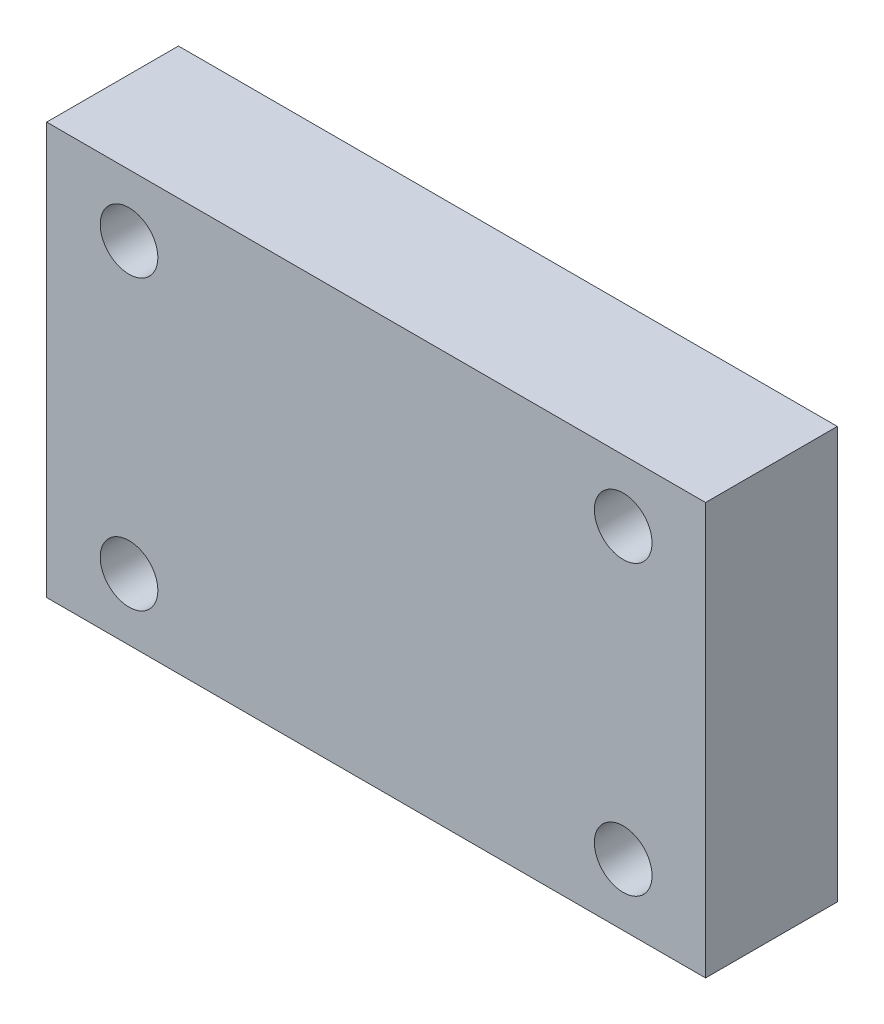
ISO-10303-21;
HEADER;
FILE_DESCRIPTION(('STEP AP214'),'2;1');
FILE_NAME('part.step','',(''),(''),'','','');
FILE_SCHEMA(('AUTOMOTIVE_DESIGN { 1 0 10303 214 1 1 1 1 }'));
ENDSEC;
DATA;
#1=APPLICATION_CONTEXT('core data for automotive mechanical design processes');
#2=APPLICATION_PROTOCOL_DEFINITION('international standard','automotive_design',2000,#1);
#3=PRODUCT_CONTEXT('',#1,'mechanical');
#4=PRODUCT('Part','Part','',(#3));
#5=PRODUCT_RELATED_PRODUCT_CATEGORY('part','',(#4));
#6=PRODUCT_DEFINITION_FORMATION('','',#4);
#7=PRODUCT_DEFINITION_CONTEXT('part definition',#1,'design');
#8=PRODUCT_DEFINITION('design','',#6,#7);
#9=PRODUCT_DEFINITION_SHAPE('','',#8);
#10=(LENGTH_UNIT() NAMED_UNIT(*) SI_UNIT(.MILLI.,.METRE.));
#11=(NAMED_UNIT(*) PLANE_ANGLE_UNIT() SI_UNIT($,.RADIAN.));
#12=(NAMED_UNIT(*) SI_UNIT($,.STERADIAN.) SOLID_ANGLE_UNIT());
#13=UNCERTAINTY_MEASURE_WITH_UNIT(LENGTH_MEASURE(1.E-05),#10,'distance_accuracy_value','');
#14=(GEOMETRIC_REPRESENTATION_CONTEXT(3) GLOBAL_UNCERTAINTY_ASSIGNED_CONTEXT((#13)) GLOBAL_UNIT_ASSIGNED_CONTEXT((#10,
#11,#12)) REPRESENTATION_CONTEXT('',''));
#15=CARTESIAN_POINT('',(0.,0.,0.));
#16=DIRECTION('',(0.,0.,1.));
#17=DIRECTION('',(1.,0.,0.));
#18=AXIS2_PLACEMENT_3D('',#15,#16,#17);
#19=CARTESIAN_POINT('',(40.,-25.,8.));
#20=DIRECTION('',(-1.,0.,0.));
#21=DIRECTION('',(0.,0.,1.));
#22=AXIS2_PLACEMENT_3D('',#19,#20,#21);
#23=PLANE('',#22);
#24=DIRECTION('',(0.,1.,0.));
#25=VECTOR('',#24,1.);
#26=CARTESIAN_POINT('',(40.,-25.,-8.));
#27=LINE('',#26,#25);
#28=CARTESIAN_POINT('',(40.,-25.,-8.));
#29=VERTEX_POINT('',#28);
#30=CARTESIAN_POINT('',(40.,25.,-8.));
#31=VERTEX_POINT('',#30);
#32=EDGE_CURVE('E97',#29,#31,#27,.T.);
#33=ORIENTED_EDGE('',*,*,#32,.T.);
#34=DIRECTION('',(0.,0.,-1.));
#35=VECTOR('',#34,1.);
#36=CARTESIAN_POINT('',(40.,25.,8.));
#37=LINE('',#36,#35);
#38=CARTESIAN_POINT('',(40.,25.,8.));
#39=VERTEX_POINT('',#38);
#40=EDGE_CURVE('E11',#39,#31,#37,.T.);
#41=ORIENTED_EDGE('',*,*,#40,.F.);
#42=DIRECTION('',(0.,1.,0.));
#43=VECTOR('',#42,1.);
#44=CARTESIAN_POINT('',(40.,-25.,8.));
#45=LINE('',#44,#43);
#46=CARTESIAN_POINT('',(40.,-25.,8.));
#47=VERTEX_POINT('',#46);
#48=EDGE_CURVE('E85',#47,#39,#45,.T.);
#49=ORIENTED_EDGE('',*,*,#48,.F.);
#50=DIRECTION('',(0.,0.,-1.));
#51=VECTOR('',#50,1.);
#52=CARTESIAN_POINT('',(40.,-25.,8.));
#53=LINE('',#52,#51);
#54=EDGE_CURVE('E93',#47,#29,#53,.T.);
#55=ORIENTED_EDGE('',*,*,#54,.T.);
#56=EDGE_LOOP('',(#33,#41,#49,#55));
#57=FACE_BOUND('',#56,.T.);
#58=ADVANCED_FACE('F34',(#57),#23,.F.);
#59=CARTESIAN_POINT('',(-40.,25.,8.));
#60=DIRECTION('',(0.,-1.,0.));
#61=DIRECTION('',(0.,0.,-1.));
#62=AXIS2_PLACEMENT_3D('',#59,#60,#61);
#63=PLANE('',#62);
#64=DIRECTION('',(-1.,0.,0.));
#65=VECTOR('',#64,1.);
#66=CARTESIAN_POINT('',(-40.,25.,-8.));
#67=LINE('',#66,#65);
#68=CARTESIAN_POINT('',(-40.,25.,-8.));
#69=VERTEX_POINT('',#68);
#70=EDGE_CURVE('E89',#31,#69,#67,.T.);
#71=ORIENTED_EDGE('',*,*,#70,.T.);
#72=DIRECTION('',(0.,0.,-1.));
#73=VECTOR('',#72,1.);
#74=CARTESIAN_POINT('',(-40.,25.,8.));
#75=LINE('',#74,#73);
#76=CARTESIAN_POINT('',(-40.,25.,8.));
#77=VERTEX_POINT('',#76);
#78=EDGE_CURVE('E42',#77,#69,#75,.T.);
#79=ORIENTED_EDGE('',*,*,#78,.F.);
#80=DIRECTION('',(-1.,0.,0.));
#81=VECTOR('',#80,1.);
#82=CARTESIAN_POINT('',(-40.,25.,8.));
#83=LINE('',#82,#81);
#84=EDGE_CURVE('E80',#39,#77,#83,.T.);
#85=ORIENTED_EDGE('',*,*,#84,.F.);
#86=ORIENTED_EDGE('',*,*,#40,.T.);
#87=EDGE_LOOP('',(#71,#79,#85,#86));
#88=FACE_BOUND('',#87,.T.);
#89=ADVANCED_FACE('F88',(#88),#63,.F.);
#90=CARTESIAN_POINT('',(-40.,-25.,8.));
#91=DIRECTION('',(1.,0.,0.));
#92=DIRECTION('',(0.,0.,-1.));
#93=AXIS2_PLACEMENT_3D('',#90,#91,#92);
#94=PLANE('',#93);
#95=DIRECTION('',(0.,-1.,0.));
#96=VECTOR('',#95,1.);
#97=CARTESIAN_POINT('',(-40.,-25.,-8.));
#98=LINE('',#97,#96);
#99=CARTESIAN_POINT('',(-40.,-25.,-8.));
#100=VERTEX_POINT('',#99);
#101=EDGE_CURVE('E67',#69,#100,#98,.T.);
#102=ORIENTED_EDGE('',*,*,#101,.T.);
#103=DIRECTION('',(0.,0.,-1.));
#104=VECTOR('',#103,1.);
#105=CARTESIAN_POINT('',(-40.,-25.,8.));
#106=LINE('',#105,#104);
#107=CARTESIAN_POINT('',(-40.,-25.,8.));
#108=VERTEX_POINT('',#107);
#109=EDGE_CURVE('E90',#108,#100,#106,.T.);
#110=ORIENTED_EDGE('',*,*,#109,.F.);
#111=DIRECTION('',(0.,-1.,0.));
#112=VECTOR('',#111,1.);
#113=CARTESIAN_POINT('',(-40.,-25.,8.));
#114=LINE('',#113,#112);
#115=EDGE_CURVE('E83',#77,#108,#114,.T.);
#116=ORIENTED_EDGE('',*,*,#115,.F.);
#117=ORIENTED_EDGE('',*,*,#78,.T.);
#118=EDGE_LOOP('',(#102,#110,#116,#117));
#119=FACE_BOUND('',#118,.T.);
#120=ADVANCED_FACE('F91',(#119),#94,.F.);
#121=CARTESIAN_POINT('',(-40.,-25.,8.));
#122=DIRECTION('',(0.,1.,0.));
#123=DIRECTION('',(0.,0.,1.));
#124=AXIS2_PLACEMENT_3D('',#121,#122,#123);
#125=PLANE('',#124);
#126=DIRECTION('',(1.,0.,0.));
#127=VECTOR('',#126,1.);
#128=CARTESIAN_POINT('',(-40.,-25.,-8.));
#129=LINE('',#128,#127);
#130=EDGE_CURVE('E73',#100,#29,#129,.T.);
#131=ORIENTED_EDGE('',*,*,#130,.T.);
#132=ORIENTED_EDGE('',*,*,#54,.F.);
#133=DIRECTION('',(1.,0.,0.));
#134=VECTOR('',#133,1.);
#135=CARTESIAN_POINT('',(-40.,-25.,8.));
#136=LINE('',#135,#134);
#137=EDGE_CURVE('E50',#108,#47,#136,.T.);
#138=ORIENTED_EDGE('',*,*,#137,.F.);
#139=ORIENTED_EDGE('',*,*,#109,.T.);
#140=EDGE_LOOP('',(#131,#132,#138,#139));
#141=FACE_BOUND('',#140,.T.);
#142=ADVANCED_FACE('F105',(#141),#125,.F.);
#143=CARTESIAN_POINT('',(0.,0.,8.));
#144=DIRECTION('',(0.,0.,-1.));
#145=DIRECTION('',(-1.,0.,0.));
#146=AXIS2_PLACEMENT_3D('',#143,#144,#145);
#147=PLANE('',#146);
#148=CARTESIAN_POINT('',(30.,17.5,8.));
#149=DIRECTION('',(0.,0.,1.));
#150=DIRECTION('',(-1.,0.,0.));
#151=AXIS2_PLACEMENT_3D('',#148,#149,#150);
#152=CIRCLE('',#151,3.5);
#153=CARTESIAN_POINT('',(26.5,17.5,8.));
#154=VERTEX_POINT('',#153);
#155=EDGE_CURVE('E124',#154,#154,#152,.T.);
#156=ORIENTED_EDGE('',*,*,#155,.F.);
#157=EDGE_LOOP('',(#156));
#158=FACE_BOUND('',#157,.T.);
#159=CARTESIAN_POINT('',(-30.,-17.5,8.));
#160=DIRECTION('',(0.,0.,1.));
#161=DIRECTION('',(1.,0.,0.));
#162=AXIS2_PLACEMENT_3D('',#159,#160,#161);
#163=CIRCLE('',#162,3.5);
#164=CARTESIAN_POINT('',(-26.5,-17.5,8.));
#165=VERTEX_POINT('',#164);
#166=EDGE_CURVE('E117',#165,#165,#163,.T.);
#167=ORIENTED_EDGE('',*,*,#166,.F.);
#168=EDGE_LOOP('',(#167));
#169=FACE_BOUND('',#168,.T.);
#170=CARTESIAN_POINT('',(30.,-17.5,8.));
#171=DIRECTION('',(0.,0.,1.));
#172=DIRECTION('',(1.,0.,0.));
#173=AXIS2_PLACEMENT_3D('',#170,#171,#172);
#174=CIRCLE('',#173,3.5);
#175=CARTESIAN_POINT('',(33.5,-17.5,8.));
#176=VERTEX_POINT('',#175);
#177=EDGE_CURVE('E129',#176,#176,#174,.T.);
#178=ORIENTED_EDGE('',*,*,#177,.F.);
#179=EDGE_LOOP('',(#178));
#180=FACE_BOUND('',#179,.T.);
#181=CARTESIAN_POINT('',(-30.,17.5,8.));
#182=DIRECTION('',(0.,0.,1.));
#183=DIRECTION('',(1.,0.,0.));
#184=AXIS2_PLACEMENT_3D('',#181,#182,#183);
#185=CIRCLE('',#184,3.5);
#186=CARTESIAN_POINT('',(-26.5,17.5,8.));
#187=VERTEX_POINT('',#186);
#188=EDGE_CURVE('E111',#187,#187,#185,.T.);
#189=ORIENTED_EDGE('',*,*,#188,.F.);
#190=EDGE_LOOP('',(#189));
#191=FACE_BOUND('',#190,.T.);
#192=ORIENTED_EDGE('',*,*,#48,.T.);
#193=ORIENTED_EDGE('',*,*,#84,.T.);
#194=ORIENTED_EDGE('',*,*,#115,.T.);
#195=ORIENTED_EDGE('',*,*,#137,.T.);
#196=EDGE_LOOP('',(#192,#193,#194,#195));
#197=FACE_BOUND('',#196,.T.);
#198=ADVANCED_FACE('F81',(#158,#169,#180,#191,#197),#147,.F.);
#199=CARTESIAN_POINT('',(0.,0.,-8.));
#200=DIRECTION('',(0.,0.,-1.));
#201=DIRECTION('',(-1.,0.,0.));
#202=AXIS2_PLACEMENT_3D('',#199,#200,#201);
#203=PLANE('',#202);
#204=CARTESIAN_POINT('',(30.,17.5,-8.));
#205=DIRECTION('',(0.,0.,1.));
#206=DIRECTION('',(-1.,0.,0.));
#207=AXIS2_PLACEMENT_3D('',#204,#205,#206);
#208=CIRCLE('',#207,3.5);
#209=CARTESIAN_POINT('',(26.5,17.5,-8.));
#210=VERTEX_POINT('',#209);
#211=EDGE_CURVE('E114',#210,#210,#208,.T.);
#212=ORIENTED_EDGE('',*,*,#211,.T.);
#213=EDGE_LOOP('',(#212));
#214=FACE_BOUND('',#213,.T.);
#215=CARTESIAN_POINT('',(-30.,-17.5,-8.));
#216=DIRECTION('',(0.,0.,1.));
#217=DIRECTION('',(1.,0.,0.));
#218=AXIS2_PLACEMENT_3D('',#215,#216,#217);
#219=CIRCLE('',#218,3.5);
#220=CARTESIAN_POINT('',(-26.5,-17.5,-8.));
#221=VERTEX_POINT('',#220);
#222=EDGE_CURVE('E120',#221,#221,#219,.T.);
#223=ORIENTED_EDGE('',*,*,#222,.T.);
#224=EDGE_LOOP('',(#223));
#225=FACE_BOUND('',#224,.T.);
#226=CARTESIAN_POINT('',(30.,-17.5,-8.));
#227=DIRECTION('',(0.,0.,1.));
#228=DIRECTION('',(1.,0.,0.));
#229=AXIS2_PLACEMENT_3D('',#226,#227,#228);
#230=CIRCLE('',#229,3.5);
#231=CARTESIAN_POINT('',(33.5,-17.5,-8.));
#232=VERTEX_POINT('',#231);
#233=EDGE_CURVE('E121',#232,#232,#230,.T.);
#234=ORIENTED_EDGE('',*,*,#233,.T.);
#235=EDGE_LOOP('',(#234));
#236=FACE_BOUND('',#235,.T.);
#237=CARTESIAN_POINT('',(-30.,17.5,-8.));
#238=DIRECTION('',(0.,0.,1.));
#239=DIRECTION('',(1.,0.,0.));
#240=AXIS2_PLACEMENT_3D('',#237,#238,#239);
#241=CIRCLE('',#240,3.5);
#242=CARTESIAN_POINT('',(-26.5,17.5,-8.));
#243=VERTEX_POINT('',#242);
#244=EDGE_CURVE('E100',#243,#243,#241,.T.);
#245=ORIENTED_EDGE('',*,*,#244,.T.);
#246=EDGE_LOOP('',(#245));
#247=FACE_BOUND('',#246,.T.);
#248=ORIENTED_EDGE('',*,*,#32,.F.);
#249=ORIENTED_EDGE('',*,*,#130,.F.);
#250=ORIENTED_EDGE('',*,*,#101,.F.);
#251=ORIENTED_EDGE('',*,*,#70,.F.);
#252=EDGE_LOOP('',(#248,#249,#250,#251));
#253=FACE_BOUND('',#252,.T.);
#254=ADVANCED_FACE('F108',(#214,#225,#236,#247,#253),#203,.T.);
#255=CARTESIAN_POINT('',(-30.,17.5,-8.));
#256=DIRECTION('',(0.,0.,1.));
#257=DIRECTION('',(1.,0.,0.));
#258=AXIS2_PLACEMENT_3D('',#255,#256,#257);
#259=CYLINDRICAL_SURFACE('',#258,3.5);
#260=ORIENTED_EDGE('',*,*,#244,.F.);
#261=EDGE_LOOP('',(#260));
#262=FACE_BOUND('',#261,.T.);
#263=ORIENTED_EDGE('',*,*,#188,.T.);
#264=EDGE_LOOP('',(#263));
#265=FACE_BOUND('',#264,.T.);
#266=ADVANCED_FACE('F141',(#262,#265),#259,.F.);
#267=CARTESIAN_POINT('',(30.,-17.5,-8.));
#268=DIRECTION('',(0.,0.,1.));
#269=DIRECTION('',(1.,0.,0.));
#270=AXIS2_PLACEMENT_3D('',#267,#268,#269);
#271=CYLINDRICAL_SURFACE('',#270,3.5);
#272=ORIENTED_EDGE('',*,*,#233,.F.);
#273=EDGE_LOOP('',(#272));
#274=FACE_BOUND('',#273,.T.);
#275=ORIENTED_EDGE('',*,*,#177,.T.);
#276=EDGE_LOOP('',(#275));
#277=FACE_BOUND('',#276,.T.);
#278=ADVANCED_FACE('F137',(#274,#277),#271,.F.);
#279=CARTESIAN_POINT('',(-30.,-17.5,-8.));
#280=DIRECTION('',(0.,0.,1.));
#281=DIRECTION('',(1.,0.,0.));
#282=AXIS2_PLACEMENT_3D('',#279,#280,#281);
#283=CYLINDRICAL_SURFACE('',#282,3.5);
#284=ORIENTED_EDGE('',*,*,#222,.F.);
#285=EDGE_LOOP('',(#284));
#286=FACE_BOUND('',#285,.T.);
#287=ORIENTED_EDGE('',*,*,#166,.T.);
#288=EDGE_LOOP('',(#287));
#289=FACE_BOUND('',#288,.T.);
#290=ADVANCED_FACE('F140',(#286,#289),#283,.F.);
#291=CARTESIAN_POINT('',(30.,17.5,-8.));
#292=DIRECTION('',(0.,0.,1.));
#293=DIRECTION('',(1.,0.,0.));
#294=AXIS2_PLACEMENT_3D('',#291,#292,#293);
#295=CYLINDRICAL_SURFACE('',#294,3.5);
#296=ORIENTED_EDGE('',*,*,#211,.F.);
#297=EDGE_LOOP('',(#296));
#298=FACE_BOUND('',#297,.T.);
#299=ORIENTED_EDGE('',*,*,#155,.T.);
#300=EDGE_LOOP('',(#299));
#301=FACE_BOUND('',#300,.T.);
#302=ADVANCED_FACE('F202',(#298,#301),#295,.F.);
#303=CLOSED_SHELL('',(#58,#89,#120,#142,#198,#254,#266,#278,#290,#302));
#304=MANIFOLD_SOLID_BREP('B2',#303);
#305=ADVANCED_BREP_SHAPE_REPRESENTATION('',(#18,#304),#14);
#306=SHAPE_DEFINITION_REPRESENTATION(#9,#305);
ENDSEC;
END-ISO-10303-21;
